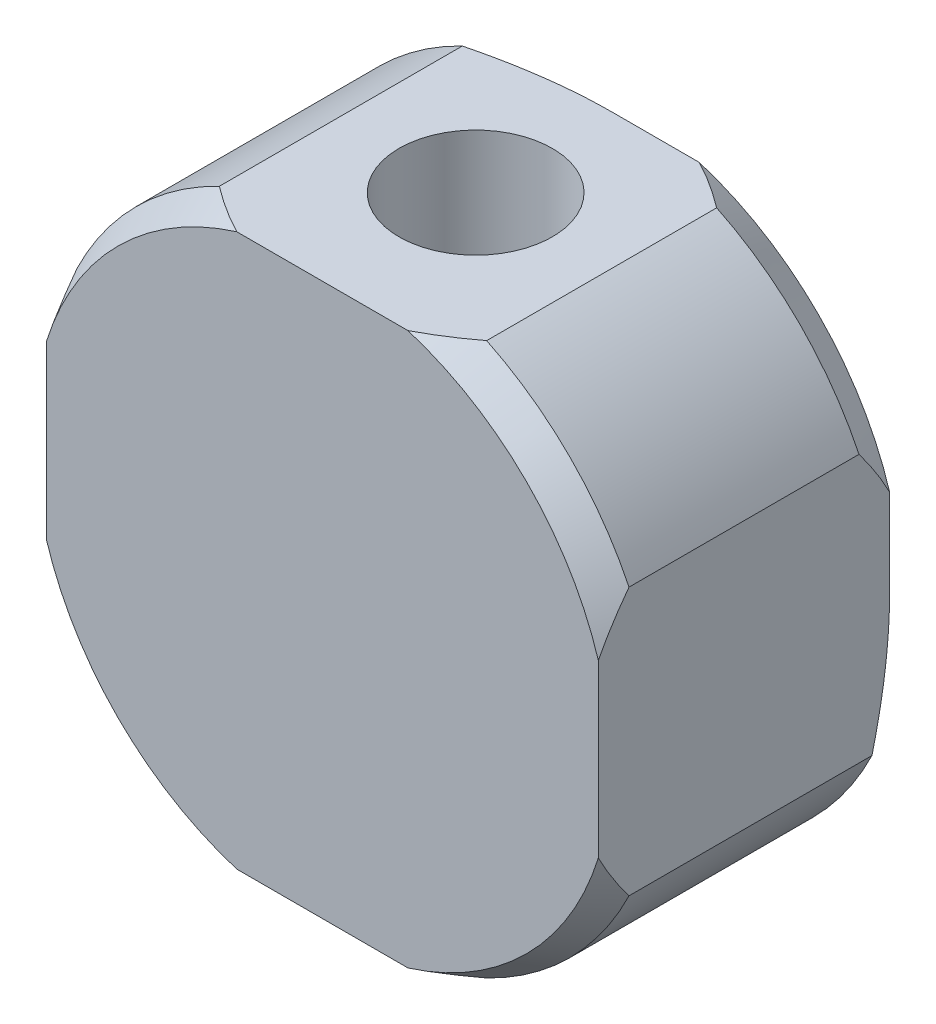
ISO-10303-21;
HEADER;
FILE_DESCRIPTION(('STEP AP214'),'2;1');
FILE_NAME('part.step','',(''),(''),'','','');
FILE_SCHEMA(('AUTOMOTIVE_DESIGN { 1 0 10303 214 1 1 1 1 }'));
ENDSEC;
DATA;
#1=APPLICATION_CONTEXT('core data for automotive mechanical design processes');
#2=APPLICATION_PROTOCOL_DEFINITION('international standard','automotive_design',2000,#1);
#3=PRODUCT_CONTEXT('',#1,'mechanical');
#4=PRODUCT('Part','Part','',(#3));
#5=PRODUCT_RELATED_PRODUCT_CATEGORY('part','',(#4));
#6=PRODUCT_DEFINITION_FORMATION('','',#4);
#7=PRODUCT_DEFINITION_CONTEXT('part definition',#1,'design');
#8=PRODUCT_DEFINITION('design','',#6,#7);
#9=PRODUCT_DEFINITION_SHAPE('','',#8);
#10=(LENGTH_UNIT() NAMED_UNIT(*) SI_UNIT(.MILLI.,.METRE.));
#11=(NAMED_UNIT(*) PLANE_ANGLE_UNIT() SI_UNIT($,.RADIAN.));
#12=(NAMED_UNIT(*) SI_UNIT($,.STERADIAN.) SOLID_ANGLE_UNIT());
#13=UNCERTAINTY_MEASURE_WITH_UNIT(LENGTH_MEASURE(1.E-05),#10,'distance_accuracy_value','');
#14=(GEOMETRIC_REPRESENTATION_CONTEXT(3) GLOBAL_UNCERTAINTY_ASSIGNED_CONTEXT((#13)) GLOBAL_UNIT_ASSIGNED_CONTEXT((#10,
#11,#12)) REPRESENTATION_CONTEXT('',''));
#15=CARTESIAN_POINT('',(0.,0.,0.));
#16=DIRECTION('',(0.,0.,1.));
#17=DIRECTION('',(1.,0.,0.));
#18=AXIS2_PLACEMENT_3D('',#15,#16,#17);
#19=CARTESIAN_POINT('',(0.,0.,9.50000000000001));
#20=DIRECTION('',(0.,0.,-1.));
#21=DIRECTION('',(-1.,0.,0.));
#22=AXIS2_PLACEMENT_3D('',#19,#20,#21);
#23=CYLINDRICAL_SURFACE('',#22,10.);
#24=DIRECTION('',(0.,0.,-1.));
#25=VECTOR('',#24,1.);
#26=CARTESIAN_POINT('',(-4.35889894354067,9.,9.5));
#27=LINE('',#26,#25);
#28=CARTESIAN_POINT('',(-4.35889894354068,9.,8.5));
#29=VERTEX_POINT('',#28);
#30=CARTESIAN_POINT('',(-4.35889894354068,9.,0.57735026918964));
#31=VERTEX_POINT('',#30);
#32=EDGE_CURVE('E364',#29,#31,#27,.T.);
#33=ORIENTED_EDGE('',*,*,#32,.T.);
#34=CARTESIAN_POINT('',(0.,0.,0.57735026918964));
#35=DIRECTION('',(0.,0.,1.));
#36=DIRECTION('',(1.,0.,0.));
#37=AXIS2_PLACEMENT_3D('',#34,#35,#36);
#38=CIRCLE('',#37,10.);
#39=CARTESIAN_POINT('',(-8.99999999999999,4.35889894354068,0.57735026918964));
#40=VERTEX_POINT('',#39);
#41=EDGE_CURVE('E398',#31,#40,#38,.T.);
#42=ORIENTED_EDGE('',*,*,#41,.T.);
#43=DIRECTION('',(0.,0.,-1.));
#44=VECTOR('',#43,1.);
#45=CARTESIAN_POINT('',(-8.99999999999999,4.35889894354068,9.5));
#46=LINE('',#45,#44);
#47=CARTESIAN_POINT('',(-8.99999999999999,4.35889894354068,8.5));
#48=VERTEX_POINT('',#47);
#49=EDGE_CURVE('E172',#48,#40,#46,.T.);
#50=ORIENTED_EDGE('',*,*,#49,.F.);
#51=CARTESIAN_POINT('',(0.,0.,8.5));
#52=DIRECTION('',(0.,0.,1.));
#53=DIRECTION('',(1.,0.,0.));
#54=AXIS2_PLACEMENT_3D('',#51,#52,#53);
#55=CIRCLE('',#54,10.);
#56=EDGE_CURVE('E231',#48,#29,#55,.F.);
#57=ORIENTED_EDGE('',*,*,#56,.T.);
#58=EDGE_LOOP('',(#33,#42,#50,#57));
#59=FACE_BOUND('',#58,.T.);
#60=ADVANCED_FACE('F36',(#59),#23,.T.);
#61=CARTESIAN_POINT('',(-8.99999999999999,4.35889894354068,9.5));
#62=DIRECTION('',(1.,0.,0.));
#63=DIRECTION('',(0.,0.,-1.));
#64=AXIS2_PLACEMENT_3D('',#61,#62,#63);
#65=PLANE('',#64);
#66=CARTESIAN_POINT('',(-8.99999999999999,4.35889894354068,0.57735026918964));
#67=CARTESIAN_POINT('',(-8.99999999999999,4.18050314028204,0.532457731019372));
#68=CARTESIAN_POINT('',(-8.99999999999999,4.00158687455103,0.489662216447558));
#69=CARTESIAN_POINT('',(-8.99999999999999,3.64267909672018,0.408660352341656));
#70=CARTESIAN_POINT('',(-8.99999999999999,3.46268735803343,0.370455008449583));
#71=CARTESIAN_POINT('',(-8.99999999999999,2.92263369369887,0.263635914482176));
#72=CARTESIAN_POINT('',(-8.99999999999999,2.56104121567905,0.202447293964424));
#73=CARTESIAN_POINT('',(-8.99999999999999,2.01622879853901,0.127817138854854));
#74=CARTESIAN_POINT('',(-8.99999999999999,1.83415074090355,0.105794088399089));
#75=CARTESIAN_POINT('',(-8.99999999999999,1.46935836557093,0.0677765215745436));
#76=CARTESIAN_POINT('',(-8.99999999999999,1.28664405347709,0.0517819522494305));
#77=CARTESIAN_POINT('',(-8.99999999999999,0.920066567165593,0.0260225867141355));
#78=CARTESIAN_POINT('',(-8.99999999999999,0.736201681512133,0.0162820951657872));
#79=CARTESIAN_POINT('',(-8.99999999999999,0.368226238571734,0.00326145442248733));
#80=CARTESIAN_POINT('',(-8.99999999999999,0.184115659254637,-1.80701811820628E-05));
#81=CARTESIAN_POINT('',(-8.99999999999999,0.,0.));
#82=B_SPLINE_CURVE_WITH_KNOTS('',3,(#66,#67,#68,#69,#70,#71,#72,#73,#74,#75,#76,#77,#78,#79,#80,
#81),.UNSPECIFIED.,.F.,.F.,(4,2,2,2,2,2,2,4),(0.,0.551840476747493,1.10380163438757,
2.2032324326341,2.75336800253714,3.30349873974013,3.85575466358834,4.40806397221874),.UNSPECIFIED.);
#83=CARTESIAN_POINT('',(-8.99999999999999,0.,0.));
#84=VERTEX_POINT('',#83);
#85=EDGE_CURVE('E277',#40,#84,#82,.T.);
#86=ORIENTED_EDGE('',*,*,#85,.T.);
#87=CARTESIAN_POINT('',(-8.99999999999999,0.,0.));
#88=CARTESIAN_POINT('',(-8.99999999999999,-0.184115659254637,-1.80701811821671E-05));
#89=CARTESIAN_POINT('',(-8.99999999999999,-0.368226238571734,0.00326145442248723));
#90=CARTESIAN_POINT('',(-8.99999999999999,-0.736201681512132,0.0162820951657872));
#91=CARTESIAN_POINT('',(-8.99999999999999,-0.920066567165592,0.0260225867141355));
#92=CARTESIAN_POINT('',(-8.99999999999999,-1.28664405347709,0.0517819522494306));
#93=CARTESIAN_POINT('',(-8.99999999999999,-1.46935836557093,0.0677765215745436));
#94=CARTESIAN_POINT('',(-8.99999999999999,-1.83415074090355,0.105794088399089));
#95=CARTESIAN_POINT('',(-8.99999999999999,-2.016228798539,0.127817138854854));
#96=CARTESIAN_POINT('',(-8.99999999999999,-2.56104121567905,0.202447293964424));
#97=CARTESIAN_POINT('',(-8.99999999999999,-2.92263369369887,0.263635914482176));
#98=CARTESIAN_POINT('',(-8.99999999999999,-3.46268735803343,0.370455008449582));
#99=CARTESIAN_POINT('',(-8.99999999999999,-3.64267909672018,0.408660352341655));
#100=CARTESIAN_POINT('',(-8.99999999999999,-4.00158687455103,0.489662216447558));
#101=CARTESIAN_POINT('',(-8.99999999999999,-4.18050314028204,0.532457731019371));
#102=CARTESIAN_POINT('',(-8.99999999999999,-4.35889894354068,0.57735026918964));
#103=B_SPLINE_CURVE_WITH_KNOTS('',3,(#87,#88,#89,#90,#91,#92,#93,#94,#95,#96,#97,#98,#99,#100,
#101,#102),.UNSPECIFIED.,.F.,.F.,(4,2,2,2,2,2,2,4),(0.,0.552309308630403,1.10456523247861,
1.6546959696816,2.20483153958464,3.30426233783117,3.85622349547125,4.40806397221874),.UNSPECIFIED.);
#104=CARTESIAN_POINT('',(-8.99999999999999,-4.35889894354068,0.57735026918964));
#105=VERTEX_POINT('',#104);
#106=EDGE_CURVE('E270',#84,#105,#103,.T.);
#107=ORIENTED_EDGE('',*,*,#106,.T.);
#108=DIRECTION('',(0.,0.,-1.));
#109=VECTOR('',#108,1.);
#110=CARTESIAN_POINT('',(-8.99999999999999,-4.35889894354068,9.5));
#111=LINE('',#110,#109);
#112=CARTESIAN_POINT('',(-8.99999999999999,-4.35889894354068,8.5));
#113=VERTEX_POINT('',#112);
#114=EDGE_CURVE('E166',#113,#105,#111,.T.);
#115=ORIENTED_EDGE('',*,*,#114,.F.);
#116=CARTESIAN_POINT('',(-8.99999999999999,-4.35889894354068,8.5));
#117=CARTESIAN_POINT('',(-8.99999999999999,-4.23493665683502,8.59356981138573));
#118=CARTESIAN_POINT('',(-8.99999999999999,-4.10941613597258,8.6851212040339));
#119=CARTESIAN_POINT('',(-8.99999999999999,-3.85525157762108,8.86325943967017));
#120=CARTESIAN_POINT('',(-8.99999999999999,-3.726613733126,8.94985513426066));
#121=CARTESIAN_POINT('',(-8.99999999999999,-3.46572204359342,9.11752430951137));
#122=CARTESIAN_POINT('',(-8.99999999999999,-3.333467384821,9.19859653289942));
#123=CARTESIAN_POINT('',(-8.99999999999999,-3.06494049887311,9.35437237002738));
#124=CARTESIAN_POINT('',(-8.99999999999999,-2.92866129078794,9.42906392238571));
#125=CARTESIAN_POINT('',(-8.99999999999999,-2.79039924554546,9.5));
#126=B_SPLINE_CURVE_WITH_KNOTS('',3,(#116,#117,#118,#119,#120,#121,#122,#123,#124,#125),
.UNSPECIFIED.,.F.,.F.,(4,2,2,2,4),(0.,0.465956165727929,0.931052274582842,1.39625389899086,
1.86231628481113),.UNSPECIFIED.);
#127=CARTESIAN_POINT('',(-8.99999999999999,-2.79039924554546,9.5));
#128=VERTEX_POINT('',#127);
#129=EDGE_CURVE('E171',#113,#128,#126,.T.);
#130=ORIENTED_EDGE('',*,*,#129,.T.);
#131=DIRECTION('',(0.,-1.,0.));
#132=VECTOR('',#131,1.);
#133=CARTESIAN_POINT('',(-8.99999999999999,4.35889894354068,9.5));
#134=LINE('',#133,#132);
#135=CARTESIAN_POINT('',(-8.99999999999999,2.79039924554546,9.5));
#136=VERTEX_POINT('',#135);
#137=EDGE_CURVE('E350',#136,#128,#134,.T.);
#138=ORIENTED_EDGE('',*,*,#137,.F.);
#139=CARTESIAN_POINT('',(-8.99999999999999,2.79039924554546,9.5));
#140=CARTESIAN_POINT('',(-8.99999999999999,2.92866129078794,9.42906392238571));
#141=CARTESIAN_POINT('',(-8.99999999999999,3.06494049887311,9.35437237002738));
#142=CARTESIAN_POINT('',(-8.99999999999999,3.333467384821,9.19859653289942));
#143=CARTESIAN_POINT('',(-8.99999999999999,3.46572204359342,9.11752430951137));
#144=CARTESIAN_POINT('',(-8.99999999999999,3.726613733126,8.94985513426065));
#145=CARTESIAN_POINT('',(-8.99999999999999,3.85525157762108,8.86325943967017));
#146=CARTESIAN_POINT('',(-8.99999999999999,4.10941613597259,8.6851212040339));
#147=CARTESIAN_POINT('',(-8.99999999999999,4.23493665683503,8.59356981138573));
#148=CARTESIAN_POINT('',(-8.99999999999999,4.35889894354068,8.5));
#149=B_SPLINE_CURVE_WITH_KNOTS('',3,(#139,#140,#141,#142,#143,#144,#145,#146,#147,#148),
.UNSPECIFIED.,.F.,.F.,(4,2,2,2,4),(0.,0.466062385820271,0.931264010228286,1.3963601190832,
1.86231628481113),.UNSPECIFIED.);
#150=EDGE_CURVE('E294',#136,#48,#149,.T.);
#151=ORIENTED_EDGE('',*,*,#150,.T.);
#152=ORIENTED_EDGE('',*,*,#49,.T.);
#153=EDGE_LOOP('',(#86,#107,#115,#130,#138,#151,#152));
#154=FACE_BOUND('',#153,.T.);
#155=ADVANCED_FACE('F282',(#154),#65,.F.);
#156=CARTESIAN_POINT('',(0.,0.,9.50000000000001));
#157=DIRECTION('',(0.,0.,-1.));
#158=DIRECTION('',(-1.,0.,0.));
#159=AXIS2_PLACEMENT_3D('',#156,#157,#158);
#160=CYLINDRICAL_SURFACE('',#159,10.);
#161=ORIENTED_EDGE('',*,*,#114,.T.);
#162=CARTESIAN_POINT('',(0.,0.,0.57735026918964));
#163=DIRECTION('',(0.,0.,1.));
#164=DIRECTION('',(1.,0.,0.));
#165=AXIS2_PLACEMENT_3D('',#162,#163,#164);
#166=CIRCLE('',#165,10.);
#167=CARTESIAN_POINT('',(-4.35889894354068,-9.,0.57735026918964));
#168=VERTEX_POINT('',#167);
#169=EDGE_CURVE('E165',#105,#168,#166,.T.);
#170=ORIENTED_EDGE('',*,*,#169,.T.);
#171=DIRECTION('',(0.,0.,-1.));
#172=VECTOR('',#171,1.);
#173=CARTESIAN_POINT('',(-4.35889894354067,-9.,9.5));
#174=LINE('',#173,#172);
#175=CARTESIAN_POINT('',(-4.35889894354068,-9.,8.5));
#176=VERTEX_POINT('',#175);
#177=EDGE_CURVE('E148',#176,#168,#174,.T.);
#178=ORIENTED_EDGE('',*,*,#177,.F.);
#179=CARTESIAN_POINT('',(0.,0.,8.5));
#180=DIRECTION('',(0.,0.,1.));
#181=DIRECTION('',(1.,0.,0.));
#182=AXIS2_PLACEMENT_3D('',#179,#180,#181);
#183=CIRCLE('',#182,10.);
#184=EDGE_CURVE('E162',#176,#113,#183,.F.);
#185=ORIENTED_EDGE('',*,*,#184,.T.);
#186=EDGE_LOOP('',(#161,#170,#178,#185));
#187=FACE_BOUND('',#186,.T.);
#188=ADVANCED_FACE('F161',(#187),#160,.T.);
#189=CARTESIAN_POINT('',(-4.35889894354067,-9.,9.5));
#190=DIRECTION('',(0.,1.,0.));
#191=DIRECTION('',(0.,0.,1.));
#192=AXIS2_PLACEMENT_3D('',#189,#190,#191);
#193=PLANE('',#192);
#194=ORIENTED_EDGE('',*,*,#177,.T.);
#195=CARTESIAN_POINT('',(-4.35889894354068,-9.,0.57735026918964));
#196=CARTESIAN_POINT('',(-4.18050314028204,-9.,0.532457731019375));
#197=CARTESIAN_POINT('',(-4.00158687455103,-9.,0.489662216447562));
#198=CARTESIAN_POINT('',(-3.64267909672018,-9.,0.40866035234166));
#199=CARTESIAN_POINT('',(-3.46268735803343,-9.,0.370455008449586));
#200=CARTESIAN_POINT('',(-2.92263369369887,-9.,0.263635914482179));
#201=CARTESIAN_POINT('',(-2.56104121567905,-9.,0.202447293964428));
#202=CARTESIAN_POINT('',(-2.016228798539,-9.,0.127817138854858));
#203=CARTESIAN_POINT('',(-1.83415074090355,-9.,0.105794088399093));
#204=CARTESIAN_POINT('',(-1.46935836557093,-9.,0.0677765215745475));
#205=CARTESIAN_POINT('',(-1.28664405347709,-9.,0.0517819522494343));
#206=CARTESIAN_POINT('',(-0.920066567165593,-9.,0.0260225867141398));
#207=CARTESIAN_POINT('',(-0.736201681512133,-9.,0.0162820951657923));
#208=CARTESIAN_POINT('',(-0.368226238571734,-9.,0.00326145442249024));
#209=CARTESIAN_POINT('',(-0.184115659254636,-9.,-1.80701811820414E-05));
#210=CARTESIAN_POINT('',(0.,-9.,0.));
#211=B_SPLINE_CURVE_WITH_KNOTS('',3,(#195,#196,#197,#198,#199,#200,#201,#202,#203,#204,#205,
#206,#207,#208,#209,#210),.UNSPECIFIED.,.F.,.F.,(4,2,2,2,2,2,2,4),(0.,0.551840476747492,
1.10380163438757,2.2032324326341,2.75336800253714,3.30349873974013,3.85575466358834,
4.40806397221874),.UNSPECIFIED.);
#212=CARTESIAN_POINT('',(0.,-9.,0.));
#213=VERTEX_POINT('',#212);
#214=EDGE_CURVE('E206',#168,#213,#211,.T.);
#215=ORIENTED_EDGE('',*,*,#214,.T.);
#216=CARTESIAN_POINT('',(0.,-8.99999999999999,0.));
#217=CARTESIAN_POINT('',(0.184115659254635,-9.,-1.80701811828591E-05));
#218=CARTESIAN_POINT('',(0.368226238571732,-9.,0.00326145442248969));
#219=CARTESIAN_POINT('',(0.73620168151213,-9.,0.0162820951657926));
#220=CARTESIAN_POINT('',(0.920066567165589,-9.,0.0260225867141408));
#221=CARTESIAN_POINT('',(1.28664405347708,-9.,0.0517819522494353));
#222=CARTESIAN_POINT('',(1.46935836557093,-9.,0.0677765215745478));
#223=CARTESIAN_POINT('',(1.83415074090354,-9.,0.105794088399093));
#224=CARTESIAN_POINT('',(2.016228798539,-9.,0.127817138854858));
#225=CARTESIAN_POINT('',(2.56104121567904,-9.,0.202447293964428));
#226=CARTESIAN_POINT('',(2.92263369369887,-9.,0.263635914482178));
#227=CARTESIAN_POINT('',(3.46268735803342,-9.,0.370455008449584));
#228=CARTESIAN_POINT('',(3.64267909672017,-9.,0.408660352341658));
#229=CARTESIAN_POINT('',(4.00158687455102,-9.,0.489662216447559));
#230=CARTESIAN_POINT('',(4.18050314028203,-9.,0.532457731019373));
#231=CARTESIAN_POINT('',(4.35889894354067,-9.,0.57735026918964));
#232=B_SPLINE_CURVE_WITH_KNOTS('',3,(#216,#217,#218,#219,#220,#221,#222,#223,#224,#225,#226,
#227,#228,#229,#230,#231),.UNSPECIFIED.,.F.,.F.,(4,2,2,2,2,2,2,4),(0.,0.552309308630401,
1.10456523247861,1.65469596968159,2.20483153958464,3.30426233783117,3.85622349547124,
4.40806397221873),.UNSPECIFIED.);
#233=CARTESIAN_POINT('',(4.35889894354067,-9.,0.57735026918964));
#234=VERTEX_POINT('',#233);
#235=EDGE_CURVE('E155',#213,#234,#232,.T.);
#236=ORIENTED_EDGE('',*,*,#235,.T.);
#237=DIRECTION('',(0.,0.,-1.));
#238=VECTOR('',#237,1.);
#239=CARTESIAN_POINT('',(4.35889894354067,-9.,9.5));
#240=LINE('',#239,#238);
#241=CARTESIAN_POINT('',(4.35889894354067,-9.,8.49999999999999));
#242=VERTEX_POINT('',#241);
#243=EDGE_CURVE('E167',#242,#234,#240,.T.);
#244=ORIENTED_EDGE('',*,*,#243,.F.);
#245=CARTESIAN_POINT('',(4.35889894354067,-9.,8.49999999999999));
#246=CARTESIAN_POINT('',(4.23493665683502,-9.,8.59356981138573));
#247=CARTESIAN_POINT('',(4.10941613597258,-9.,8.6851212040339));
#248=CARTESIAN_POINT('',(3.85525157762108,-9.,8.86325943967016));
#249=CARTESIAN_POINT('',(3.72661373312599,-9.,8.94985513426065));
#250=CARTESIAN_POINT('',(3.46572204359341,-9.,9.11752430951136));
#251=CARTESIAN_POINT('',(3.33346738482099,-9.,9.19859653289941));
#252=CARTESIAN_POINT('',(3.0649404988731,-9.,9.35437237002738));
#253=CARTESIAN_POINT('',(2.92866129078794,-9.,9.42906392238571));
#254=CARTESIAN_POINT('',(2.79039924554546,-9.,9.5));
#255=B_SPLINE_CURVE_WITH_KNOTS('',3,(#245,#246,#247,#248,#249,#250,#251,#252,#253,#254),
.UNSPECIFIED.,.F.,.F.,(4,2,2,2,4),(0.,0.465956165727928,0.931052274582843,1.39625389899086,
1.86231628481113),.UNSPECIFIED.);
#256=CARTESIAN_POINT('',(2.79039924554546,-9.,9.5));
#257=VERTEX_POINT('',#256);
#258=EDGE_CURVE('E156',#242,#257,#255,.T.);
#259=ORIENTED_EDGE('',*,*,#258,.T.);
#260=DIRECTION('',(1.,0.,0.));
#261=VECTOR('',#260,1.);
#262=CARTESIAN_POINT('',(-4.35889894354067,-9.,9.5));
#263=LINE('',#262,#261);
#264=CARTESIAN_POINT('',(-2.79039924554544,-9.,9.5));
#265=VERTEX_POINT('',#264);
#266=EDGE_CURVE('E150',#265,#257,#263,.T.);
#267=ORIENTED_EDGE('',*,*,#266,.F.);
#268=CARTESIAN_POINT('',(-2.79039924554544,-9.,9.5));
#269=CARTESIAN_POINT('',(-2.92866129078793,-9.,9.42906392238572));
#270=CARTESIAN_POINT('',(-3.06494049887309,-9.,9.35437237002738));
#271=CARTESIAN_POINT('',(-3.33346738482099,-9.,9.19859653289941));
#272=CARTESIAN_POINT('',(-3.4657220435934,-9.,9.11752430951136));
#273=CARTESIAN_POINT('',(-3.72661373312598,-9.,8.94985513426065));
#274=CARTESIAN_POINT('',(-3.85525157762107,-9.,8.86325943967016));
#275=CARTESIAN_POINT('',(-4.10941613597258,-9.,8.6851212040339));
#276=CARTESIAN_POINT('',(-4.23493665683502,-9.,8.59356981138573));
#277=CARTESIAN_POINT('',(-4.35889894354068,-9.,8.5));
#278=B_SPLINE_CURVE_WITH_KNOTS('',3,(#268,#269,#270,#271,#272,#273,#274,#275,#276,#277),
.UNSPECIFIED.,.F.,.F.,(4,2,2,2,4),(0.,0.466062385820276,0.931264010228295,1.39636011908321,
1.86231628481115),.UNSPECIFIED.);
#279=EDGE_CURVE('E144',#265,#176,#278,.T.);
#280=ORIENTED_EDGE('',*,*,#279,.T.);
#281=EDGE_LOOP('',(#194,#215,#236,#244,#259,#267,#280));
#282=FACE_BOUND('',#281,.T.);
#283=ADVANCED_FACE('F146',(#282),#193,.F.);
#284=CARTESIAN_POINT('',(0.,0.,9.50000000000001));
#285=DIRECTION('',(0.,0.,-1.));
#286=DIRECTION('',(-1.,0.,0.));
#287=AXIS2_PLACEMENT_3D('',#284,#285,#286);
#288=CYLINDRICAL_SURFACE('',#287,10.);
#289=ORIENTED_EDGE('',*,*,#243,.T.);
#290=CARTESIAN_POINT('',(0.,0.,0.57735026918964));
#291=DIRECTION('',(0.,0.,1.));
#292=DIRECTION('',(1.,0.,0.));
#293=AXIS2_PLACEMENT_3D('',#290,#291,#292);
#294=CIRCLE('',#293,10.);
#295=CARTESIAN_POINT('',(8.99999999999999,-4.35889894354068,0.57735026918964));
#296=VERTEX_POINT('',#295);
#297=EDGE_CURVE('E261',#234,#296,#294,.T.);
#298=ORIENTED_EDGE('',*,*,#297,.T.);
#299=DIRECTION('',(0.,0.,-1.));
#300=VECTOR('',#299,1.);
#301=CARTESIAN_POINT('',(8.99999999999999,-4.35889894354068,9.5));
#302=LINE('',#301,#300);
#303=CARTESIAN_POINT('',(8.99999999999999,-4.35889894354068,8.5));
#304=VERTEX_POINT('',#303);
#305=EDGE_CURVE('E372',#304,#296,#302,.T.);
#306=ORIENTED_EDGE('',*,*,#305,.F.);
#307=CARTESIAN_POINT('',(0.,0.,8.5));
#308=DIRECTION('',(0.,0.,1.));
#309=DIRECTION('',(1.,0.,0.));
#310=AXIS2_PLACEMENT_3D('',#307,#308,#309);
#311=CIRCLE('',#310,10.);
#312=EDGE_CURVE('E266',#304,#242,#311,.F.);
#313=ORIENTED_EDGE('',*,*,#312,.T.);
#314=EDGE_LOOP('',(#289,#298,#306,#313));
#315=FACE_BOUND('',#314,.T.);
#316=ADVANCED_FACE('F196',(#315),#288,.T.);
#317=CARTESIAN_POINT('',(8.99999999999999,4.35889894354068,9.5));
#318=DIRECTION('',(-1.,0.,0.));
#319=DIRECTION('',(0.,0.,1.));
#320=AXIS2_PLACEMENT_3D('',#317,#318,#319);
#321=PLANE('',#320);
#322=ORIENTED_EDGE('',*,*,#305,.T.);
#323=CARTESIAN_POINT('',(8.99999999999999,-4.35889894354068,0.57735026918964));
#324=CARTESIAN_POINT('',(8.99999999999999,-4.18050314028204,0.532457731019372));
#325=CARTESIAN_POINT('',(8.99999999999999,-4.00158687455103,0.489662216447559));
#326=CARTESIAN_POINT('',(8.99999999999999,-3.64267909672018,0.408660352341657));
#327=CARTESIAN_POINT('',(8.99999999999999,-3.46268735803343,0.370455008449583));
#328=CARTESIAN_POINT('',(8.99999999999999,-2.92263369369887,0.263635914482177));
#329=CARTESIAN_POINT('',(8.99999999999999,-2.56104121567905,0.202447293964425));
#330=CARTESIAN_POINT('',(8.99999999999999,-2.01622879853901,0.127817138854855));
#331=CARTESIAN_POINT('',(8.99999999999999,-1.83415074090355,0.10579408839909));
#332=CARTESIAN_POINT('',(8.99999999999999,-1.46935836557093,0.0677765215745445));
#333=CARTESIAN_POINT('',(8.99999999999999,-1.28664405347709,0.0517819522494314));
#334=CARTESIAN_POINT('',(8.99999999999999,-0.920066567165593,0.0260225867141365));
#335=CARTESIAN_POINT('',(8.99999999999999,-0.736201681512133,0.0162820951657883));
#336=CARTESIAN_POINT('',(8.99999999999999,-0.368226238571734,0.00326145442248819));
#337=CARTESIAN_POINT('',(8.99999999999999,-0.184115659254637,-1.80701811814738E-05));
#338=CARTESIAN_POINT('',(8.99999999999999,0.,0.));
#339=B_SPLINE_CURVE_WITH_KNOTS('',3,(#323,#324,#325,#326,#327,#328,#329,#330,#331,#332,#333,
#334,#335,#336,#337,#338),.UNSPECIFIED.,.F.,.F.,(4,2,2,2,2,2,2,4),(0.,0.551840476747493,
1.10380163438757,2.2032324326341,2.75336800253714,3.30349873974013,3.85575466358834,
4.40806397221874),.UNSPECIFIED.);
#340=CARTESIAN_POINT('',(8.99999999999999,0.,0.));
#341=VERTEX_POINT('',#340);
#342=EDGE_CURVE('E225',#296,#341,#339,.T.);
#343=ORIENTED_EDGE('',*,*,#342,.T.);
#344=DIRECTION('',(0.,1.,0.));
#345=VECTOR('',#344,1.);
#346=CARTESIAN_POINT('',(8.99999999999999,4.35889894354068,0.));
#347=LINE('',#346,#345);
#348=CARTESIAN_POINT('',(8.99999999999999,2.79039924554546,0.));
#349=VERTEX_POINT('',#348);
#350=EDGE_CURVE('E357',#341,#349,#347,.T.);
#351=ORIENTED_EDGE('',*,*,#350,.T.);
#352=CARTESIAN_POINT('',(8.99999999999999,2.79039924554546,0.));
#353=CARTESIAN_POINT('',(8.99999999999999,2.92866129078794,0.0709360776142915));
#354=CARTESIAN_POINT('',(8.99999999999999,3.0649404988731,0.145627629972627));
#355=CARTESIAN_POINT('',(8.99999999999999,3.333467384821,0.301403467100593));
#356=CARTESIAN_POINT('',(8.99999999999999,3.46572204359342,0.382475690488642));
#357=CARTESIAN_POINT('',(8.99999999999999,3.726613733126,0.550144865739353));
#358=CARTESIAN_POINT('',(8.99999999999999,3.85525157762108,0.636740560329839));
#359=CARTESIAN_POINT('',(8.99999999999999,4.10941613597259,0.814878795966104));
#360=CARTESIAN_POINT('',(8.99999999999999,4.23493665683503,0.906430188614275));
#361=CARTESIAN_POINT('',(8.99999999999999,4.35889894354068,1.00000000000001));
#362=B_SPLINE_CURVE_WITH_KNOTS('',3,(#352,#353,#354,#355,#356,#357,#358,#359,#360,#361),
.UNSPECIFIED.,.F.,.F.,(4,2,2,2,4),(0.,0.466062385820273,0.931264010228288,1.3963601190832,
1.86231628481113),.UNSPECIFIED.);
#363=CARTESIAN_POINT('',(8.99999999999999,4.35889894354068,1.00000000000001));
#364=VERTEX_POINT('',#363);
#365=EDGE_CURVE('E232',#349,#364,#362,.T.);
#366=ORIENTED_EDGE('',*,*,#365,.T.);
#367=DIRECTION('',(0.,0.,-1.));
#368=VECTOR('',#367,1.);
#369=CARTESIAN_POINT('',(8.99999999999999,4.35889894354068,9.5));
#370=LINE('',#369,#368);
#371=CARTESIAN_POINT('',(8.99999999999999,4.35889894354068,8.5));
#372=VERTEX_POINT('',#371);
#373=EDGE_CURVE('E369',#372,#364,#370,.T.);
#374=ORIENTED_EDGE('',*,*,#373,.F.);
#375=CARTESIAN_POINT('',(8.99999999999999,4.35889894354068,8.5));
#376=CARTESIAN_POINT('',(8.99999999999999,4.23493665683503,8.59356981138573));
#377=CARTESIAN_POINT('',(8.99999999999999,4.10941613597259,8.6851212040339));
#378=CARTESIAN_POINT('',(8.99999999999999,3.85525157762108,8.86325943967017));
#379=CARTESIAN_POINT('',(8.99999999999999,3.726613733126,8.94985513426065));
#380=CARTESIAN_POINT('',(8.99999999999999,3.46572204359342,9.11752430951137));
#381=CARTESIAN_POINT('',(8.99999999999999,3.333467384821,9.19859653289942));
#382=CARTESIAN_POINT('',(8.99999999999999,3.06494049887311,9.35437237002738));
#383=CARTESIAN_POINT('',(8.99999999999999,2.92866129078794,9.42906392238571));
#384=CARTESIAN_POINT('',(8.99999999999999,2.79039924554546,9.5));
#385=B_SPLINE_CURVE_WITH_KNOTS('',3,(#375,#376,#377,#378,#379,#380,#381,#382,#383,#384),
.UNSPECIFIED.,.F.,.F.,(4,2,2,2,4),(0.,0.46595616572793,0.931052274582844,1.39625389899086,
1.86231628481113),.UNSPECIFIED.);
#386=CARTESIAN_POINT('',(8.99999999999999,2.79039924554546,9.5));
#387=VERTEX_POINT('',#386);
#388=EDGE_CURVE('E248',#372,#387,#385,.T.);
#389=ORIENTED_EDGE('',*,*,#388,.T.);
#390=DIRECTION('',(0.,1.,0.));
#391=VECTOR('',#390,1.);
#392=CARTESIAN_POINT('',(8.99999999999999,4.35889894354068,9.5));
#393=LINE('',#392,#391);
#394=CARTESIAN_POINT('',(8.99999999999999,-2.79039924554546,9.5));
#395=VERTEX_POINT('',#394);
#396=EDGE_CURVE('E354',#395,#387,#393,.T.);
#397=ORIENTED_EDGE('',*,*,#396,.F.);
#398=CARTESIAN_POINT('',(8.99999999999999,-2.79039924554546,9.5));
#399=CARTESIAN_POINT('',(8.99999999999999,-2.92866129078794,9.42906392238571));
#400=CARTESIAN_POINT('',(8.99999999999999,-3.06494049887311,9.35437237002738));
#401=CARTESIAN_POINT('',(8.99999999999999,-3.333467384821,9.19859653289942));
#402=CARTESIAN_POINT('',(8.99999999999999,-3.46572204359342,9.11752430951137));
#403=CARTESIAN_POINT('',(8.99999999999999,-3.726613733126,8.94985513426065));
#404=CARTESIAN_POINT('',(8.99999999999999,-3.85525157762108,8.86325943967017));
#405=CARTESIAN_POINT('',(8.99999999999999,-4.10941613597259,8.6851212040339));
#406=CARTESIAN_POINT('',(8.99999999999999,-4.23493665683503,8.59356981138573));
#407=CARTESIAN_POINT('',(8.99999999999999,-4.35889894354068,8.5));
#408=B_SPLINE_CURVE_WITH_KNOTS('',3,(#398,#399,#400,#401,#402,#403,#404,#405,#406,#407),
.UNSPECIFIED.,.F.,.F.,(4,2,2,2,4),(0.,0.466062385820271,0.931264010228286,1.3963601190832,
1.86231628481113),.UNSPECIFIED.);
#409=EDGE_CURVE('E254',#395,#304,#408,.T.);
#410=ORIENTED_EDGE('',*,*,#409,.T.);
#411=EDGE_LOOP('',(#322,#343,#351,#366,#374,#389,#397,#410));
#412=FACE_BOUND('',#411,.T.);
#413=ADVANCED_FACE('F238',(#412),#321,.F.);
#414=CARTESIAN_POINT('',(0.,0.,9.50000000000001));
#415=DIRECTION('',(0.,0.,-1.));
#416=DIRECTION('',(-1.,0.,0.));
#417=AXIS2_PLACEMENT_3D('',#414,#415,#416);
#418=CYLINDRICAL_SURFACE('',#417,10.);
#419=ORIENTED_EDGE('',*,*,#373,.T.);
#420=CARTESIAN_POINT('',(0.,0.,1.00000000000001));
#421=DIRECTION('',(0.,0.,1.));
#422=DIRECTION('',(1.,0.,0.));
#423=AXIS2_PLACEMENT_3D('',#420,#421,#422);
#424=CIRCLE('',#423,10.);
#425=CARTESIAN_POINT('',(4.35889894354068,9.,1.00000000000001));
#426=VERTEX_POINT('',#425);
#427=EDGE_CURVE('E338',#364,#426,#424,.T.);
#428=ORIENTED_EDGE('',*,*,#427,.T.);
#429=DIRECTION('',(0.,0.,-1.));
#430=VECTOR('',#429,1.);
#431=CARTESIAN_POINT('',(4.35889894354067,9.,9.5));
#432=LINE('',#431,#430);
#433=CARTESIAN_POINT('',(4.35889894354067,9.,8.49999999999999));
#434=VERTEX_POINT('',#433);
#435=EDGE_CURVE('E367',#434,#426,#432,.T.);
#436=ORIENTED_EDGE('',*,*,#435,.F.);
#437=CARTESIAN_POINT('',(0.,0.,8.5));
#438=DIRECTION('',(0.,0.,1.));
#439=DIRECTION('',(1.,0.,0.));
#440=AXIS2_PLACEMENT_3D('',#437,#438,#439);
#441=CIRCLE('',#440,10.);
#442=EDGE_CURVE('E336',#434,#372,#441,.F.);
#443=ORIENTED_EDGE('',*,*,#442,.T.);
#444=EDGE_LOOP('',(#419,#428,#436,#443));
#445=FACE_BOUND('',#444,.T.);
#446=ADVANCED_FACE('F242',(#445),#418,.T.);
#447=CARTESIAN_POINT('',(-4.35889894354067,9.,9.5));
#448=DIRECTION('',(0.,-1.,0.));
#449=DIRECTION('',(0.,0.,-1.));
#450=AXIS2_PLACEMENT_3D('',#447,#448,#449);
#451=PLANE('',#450);
#452=CARTESIAN_POINT('',(0.,9.,4.5));
#453=DIRECTION('',(0.,1.,0.));
#454=DIRECTION('',(-1.,0.,0.));
#455=AXIS2_PLACEMENT_3D('',#452,#453,#454);
#456=CIRCLE('',#455,2.5);
#457=CARTESIAN_POINT('',(-2.5,9.,4.5));
#458=VERTEX_POINT('',#457);
#459=EDGE_CURVE('E527',#458,#458,#456,.T.);
#460=ORIENTED_EDGE('',*,*,#459,.F.);
#461=EDGE_LOOP('',(#460));
#462=FACE_BOUND('',#461,.T.);
#463=DIRECTION('',(-1.,0.,0.));
#464=VECTOR('',#463,1.);
#465=CARTESIAN_POINT('',(-4.35889894354068,9.,0.));
#466=LINE('',#465,#464);
#467=CARTESIAN_POINT('',(2.79039924554544,9.,0.));
#468=VERTEX_POINT('',#467);
#469=CARTESIAN_POINT('',(0.,9.,0.));
#470=VERTEX_POINT('',#469);
#471=EDGE_CURVE('E352',#468,#470,#466,.T.);
#472=ORIENTED_EDGE('',*,*,#471,.T.);
#473=CARTESIAN_POINT('',(0.,8.99999999999999,0.));
#474=CARTESIAN_POINT('',(-0.184115659254637,9.,-1.80701811820211E-05));
#475=CARTESIAN_POINT('',(-0.368226238571734,9.,0.00326145442249025));
#476=CARTESIAN_POINT('',(-0.736201681512132,9.,0.0162820951657923));
#477=CARTESIAN_POINT('',(-0.920066567165592,9.,0.0260225867141398));
#478=CARTESIAN_POINT('',(-1.28664405347709,9.,0.0517819522494343));
#479=CARTESIAN_POINT('',(-1.46935836557093,9.,0.0677765215745475));
#480=CARTESIAN_POINT('',(-1.83415074090355,9.,0.105794088399093));
#481=CARTESIAN_POINT('',(-2.016228798539,9.,0.127817138854858));
#482=CARTESIAN_POINT('',(-2.56104121567905,9.,0.202447293964428));
#483=CARTESIAN_POINT('',(-2.92263369369887,9.,0.263635914482179));
#484=CARTESIAN_POINT('',(-3.46268735803343,9.,0.370455008449586));
#485=CARTESIAN_POINT('',(-3.64267909672018,9.,0.40866035234166));
#486=CARTESIAN_POINT('',(-4.00158687455103,9.,0.489662216447562));
#487=CARTESIAN_POINT('',(-4.18050314028204,9.,0.532457731019375));
#488=CARTESIAN_POINT('',(-4.35889894354068,9.,0.57735026918964));
#489=B_SPLINE_CURVE_WITH_KNOTS('',3,(#473,#474,#475,#476,#477,#478,#479,#480,#481,#482,#483,
#484,#485,#486,#487,#488),.UNSPECIFIED.,.F.,.F.,(4,2,2,2,2,2,2,4),(0.,0.552309308630403,
1.10456523247861,1.6546959696816,2.20483153958464,3.30426233783118,3.85622349547125,
4.40806397221874),.UNSPECIFIED.);
#490=EDGE_CURVE('E331',#470,#31,#489,.T.);
#491=ORIENTED_EDGE('',*,*,#490,.T.);
#492=ORIENTED_EDGE('',*,*,#32,.F.);
#493=CARTESIAN_POINT('',(-4.35889894354068,9.,8.5));
#494=CARTESIAN_POINT('',(-4.23493665683502,9.,8.59356981138573));
#495=CARTESIAN_POINT('',(-4.10941613597258,9.,8.6851212040339));
#496=CARTESIAN_POINT('',(-3.85525157762107,9.,8.86325943967016));
#497=CARTESIAN_POINT('',(-3.72661373312598,9.,8.94985513426065));
#498=CARTESIAN_POINT('',(-3.4657220435934,9.,9.11752430951136));
#499=CARTESIAN_POINT('',(-3.33346738482099,9.,9.19859653289941));
#500=CARTESIAN_POINT('',(-3.06494049887309,9.,9.35437237002738));
#501=CARTESIAN_POINT('',(-2.92866129078793,9.,9.42906392238572));
#502=CARTESIAN_POINT('',(-2.79039924554544,9.,9.5));
#503=B_SPLINE_CURVE_WITH_KNOTS('',3,(#493,#494,#495,#496,#497,#498,#499,#500,#501,#502),
.UNSPECIFIED.,.F.,.F.,(4,2,2,2,4),(0.,0.465956165727933,0.931052274582851,1.39625389899087,
1.86231628481115),.UNSPECIFIED.);
#504=CARTESIAN_POINT('',(-2.79039924554544,9.,9.5));
#505=VERTEX_POINT('',#504);
#506=EDGE_CURVE('E308',#29,#505,#503,.T.);
#507=ORIENTED_EDGE('',*,*,#506,.T.);
#508=DIRECTION('',(-1.,0.,0.));
#509=VECTOR('',#508,1.);
#510=CARTESIAN_POINT('',(-4.35889894354067,9.,9.5));
#511=LINE('',#510,#509);
#512=CARTESIAN_POINT('',(2.79039924554546,9.,9.5));
#513=VERTEX_POINT('',#512);
#514=EDGE_CURVE('E362',#513,#505,#511,.T.);
#515=ORIENTED_EDGE('',*,*,#514,.F.);
#516=CARTESIAN_POINT('',(2.79039924554546,9.,9.5));
#517=CARTESIAN_POINT('',(2.92866129078794,9.,9.42906392238571));
#518=CARTESIAN_POINT('',(3.0649404988731,9.,9.35437237002738));
#519=CARTESIAN_POINT('',(3.33346738482099,9.,9.19859653289941));
#520=CARTESIAN_POINT('',(3.46572204359341,9.,9.11752430951136));
#521=CARTESIAN_POINT('',(3.72661373312599,9.,8.94985513426065));
#522=CARTESIAN_POINT('',(3.85525157762108,9.,8.86325943967016));
#523=CARTESIAN_POINT('',(4.10941613597258,9.,8.6851212040339));
#524=CARTESIAN_POINT('',(4.23493665683502,9.,8.59356981138573));
#525=CARTESIAN_POINT('',(4.35889894354067,9.,8.49999999999999));
#526=B_SPLINE_CURVE_WITH_KNOTS('',3,(#516,#517,#518,#519,#520,#521,#522,#523,#524,#525),
.UNSPECIFIED.,.F.,.F.,(4,2,2,2,4),(0.,0.466062385820272,0.931264010228286,1.3963601190832,
1.86231628481113),.UNSPECIFIED.);
#527=EDGE_CURVE('E58',#513,#434,#526,.T.);
#528=ORIENTED_EDGE('',*,*,#527,.T.);
#529=ORIENTED_EDGE('',*,*,#435,.T.);
#530=CARTESIAN_POINT('',(4.35889894354068,9.,1.00000000000001));
#531=CARTESIAN_POINT('',(4.23493665683502,9.,0.906430188614278));
#532=CARTESIAN_POINT('',(4.10941613597257,9.,0.814878795966107));
#533=CARTESIAN_POINT('',(3.85525157762107,9.,0.636740560329843));
#534=CARTESIAN_POINT('',(3.72661373312598,9.,0.550144865739356));
#535=CARTESIAN_POINT('',(3.4657220435934,9.,0.382475690488644));
#536=CARTESIAN_POINT('',(3.33346738482098,9.,0.301403467100593));
#537=CARTESIAN_POINT('',(3.06494049887309,9.,0.145627629972628));
#538=CARTESIAN_POINT('',(2.92866129078792,9.,0.0709360776142944));
#539=CARTESIAN_POINT('',(2.79039924554544,9.,0.));
#540=B_SPLINE_CURVE_WITH_KNOTS('',3,(#530,#531,#532,#533,#534,#535,#536,#537,#538,#539),
.UNSPECIFIED.,.F.,.F.,(4,2,2,2,4),(0.,0.465956165727932,0.931052274582849,1.39625389899087,
1.86231628481114),.UNSPECIFIED.);
#541=EDGE_CURVE('E50',#426,#468,#540,.T.);
#542=ORIENTED_EDGE('',*,*,#541,.T.);
#543=EDGE_LOOP('',(#472,#491,#492,#507,#515,#528,#529,#542));
#544=FACE_BOUND('',#543,.T.);
#545=ADVANCED_FACE('F321',(#462,#544),#451,.F.);
#546=CARTESIAN_POINT('',(0.,0.,9.50000000000001));
#547=DIRECTION('',(0.,0.,1.));
#548=DIRECTION('',(1.,0.,0.));
#549=AXIS2_PLACEMENT_3D('',#546,#547,#548);
#550=PLANE('',#549);
#551=ORIENTED_EDGE('',*,*,#514,.T.);
#552=CARTESIAN_POINT('',(0.,0.,9.50000000000001));
#553=DIRECTION('',(0.,0.,1.));
#554=DIRECTION('',(1.,0.,0.));
#555=AXIS2_PLACEMENT_3D('',#552,#553,#554);
#556=CIRCLE('',#555,9.42264973081036);
#557=EDGE_CURVE('E11',#505,#136,#556,.T.);
#558=ORIENTED_EDGE('',*,*,#557,.T.);
#559=ORIENTED_EDGE('',*,*,#137,.T.);
#560=CARTESIAN_POINT('',(0.,0.,9.50000000000001));
#561=DIRECTION('',(0.,0.,1.));
#562=DIRECTION('',(1.,0.,0.));
#563=AXIS2_PLACEMENT_3D('',#560,#561,#562);
#564=CIRCLE('',#563,9.42264973081036);
#565=EDGE_CURVE('E43',#128,#265,#564,.T.);
#566=ORIENTED_EDGE('',*,*,#565,.T.);
#567=ORIENTED_EDGE('',*,*,#266,.T.);
#568=CARTESIAN_POINT('',(0.,0.,9.50000000000001));
#569=DIRECTION('',(0.,0.,1.));
#570=DIRECTION('',(1.,0.,0.));
#571=AXIS2_PLACEMENT_3D('',#568,#569,#570);
#572=CIRCLE('',#571,9.42264973081036);
#573=EDGE_CURVE('E343',#257,#395,#572,.T.);
#574=ORIENTED_EDGE('',*,*,#573,.T.);
#575=ORIENTED_EDGE('',*,*,#396,.T.);
#576=CARTESIAN_POINT('',(0.,0.,9.50000000000001));
#577=DIRECTION('',(0.,0.,1.));
#578=DIRECTION('',(1.,0.,0.));
#579=AXIS2_PLACEMENT_3D('',#576,#577,#578);
#580=CIRCLE('',#579,9.42264973081036);
#581=EDGE_CURVE('E340',#387,#513,#580,.T.);
#582=ORIENTED_EDGE('',*,*,#581,.T.);
#583=EDGE_LOOP('',(#551,#558,#559,#566,#567,#574,#575,#582));
#584=FACE_BOUND('',#583,.T.);
#585=ADVANCED_FACE('F325',(#584),#550,.T.);
#586=CARTESIAN_POINT('',(0.,0.,0.));
#587=DIRECTION('',(0.,0.,1.));
#588=DIRECTION('',(1.,0.,0.));
#589=AXIS2_PLACEMENT_3D('',#586,#587,#588);
#590=PLANE('',#589);
#591=ORIENTED_EDGE('',*,*,#350,.F.);
#592=CARTESIAN_POINT('',(0.,0.,0.));
#593=DIRECTION('',(0.,0.,1.));
#594=DIRECTION('',(1.,0.,0.));
#595=AXIS2_PLACEMENT_3D('',#592,#593,#594);
#596=CIRCLE('',#595,8.99999999999999);
#597=EDGE_CURVE('E389',#341,#213,#596,.F.);
#598=ORIENTED_EDGE('',*,*,#597,.T.);
#599=CARTESIAN_POINT('',(0.,0.,0.));
#600=DIRECTION('',(0.,0.,1.));
#601=DIRECTION('',(1.,0.,0.));
#602=AXIS2_PLACEMENT_3D('',#599,#600,#601);
#603=CIRCLE('',#602,9.);
#604=EDGE_CURVE('E379',#213,#84,#603,.F.);
#605=ORIENTED_EDGE('',*,*,#604,.T.);
#606=CARTESIAN_POINT('',(0.,0.,0.));
#607=DIRECTION('',(0.,0.,1.));
#608=DIRECTION('',(1.,0.,0.));
#609=AXIS2_PLACEMENT_3D('',#606,#607,#608);
#610=CIRCLE('',#609,9.);
#611=EDGE_CURVE('E382',#84,#470,#610,.F.);
#612=ORIENTED_EDGE('',*,*,#611,.T.);
#613=ORIENTED_EDGE('',*,*,#471,.F.);
#614=CARTESIAN_POINT('',(0.,0.,0.));
#615=DIRECTION('',(0.,0.,1.));
#616=DIRECTION('',(1.,0.,0.));
#617=AXIS2_PLACEMENT_3D('',#614,#615,#616);
#618=CIRCLE('',#617,9.42264973081036);
#619=EDGE_CURVE('E381',#468,#349,#618,.F.);
#620=ORIENTED_EDGE('',*,*,#619,.T.);
#621=EDGE_LOOP('',(#591,#598,#605,#612,#613,#620));
#622=FACE_BOUND('',#621,.T.);
#623=ADVANCED_FACE('F395',(#622),#590,.F.);
#624=CARTESIAN_POINT('',(0.,4.,4.5));
#625=DIRECTION('',(0.,1.,0.));
#626=DIRECTION('',(-1.,0.,0.));
#627=AXIS2_PLACEMENT_3D('',#624,#625,#626);
#628=CYLINDRICAL_SURFACE('',#627,2.5);
#629=CARTESIAN_POINT('',(0.,4.,4.5));
#630=DIRECTION('',(0.,1.,0.));
#631=DIRECTION('',(-1.,0.,0.));
#632=AXIS2_PLACEMENT_3D('',#629,#630,#631);
#633=CIRCLE('',#632,2.5);
#634=CARTESIAN_POINT('',(-2.5,4.,4.5));
#635=VERTEX_POINT('',#634);
#636=EDGE_CURVE('E525',#635,#635,#633,.T.);
#637=ORIENTED_EDGE('',*,*,#636,.F.);
#638=EDGE_LOOP('',(#637));
#639=FACE_BOUND('',#638,.T.);
#640=ORIENTED_EDGE('',*,*,#459,.T.);
#641=EDGE_LOOP('',(#640));
#642=FACE_BOUND('',#641,.T.);
#643=ADVANCED_FACE('F457',(#639,#642),#628,.F.);
#644=CARTESIAN_POINT('',(0.,4.,4.5));
#645=DIRECTION('',(0.,1.,0.));
#646=DIRECTION('',(-1.,0.,0.));
#647=AXIS2_PLACEMENT_3D('',#644,#645,#646);
#648=PLANE('',#647);
#649=ORIENTED_EDGE('',*,*,#636,.T.);
#650=EDGE_LOOP('',(#649));
#651=FACE_BOUND('',#650,.T.);
#652=ADVANCED_FACE('F463',(#651),#648,.T.);
#653=CARTESIAN_POINT('',(0.,0.,0.57735026918964));
#654=DIRECTION('',(0.,0.,1.));
#655=DIRECTION('',(1.,0.,0.));
#656=AXIS2_PLACEMENT_3D('',#653,#654,#655);
#657=CONICAL_SURFACE('',#656,10.,1.04719755119659);
#658=ORIENTED_EDGE('',*,*,#106,.F.);
#659=ORIENTED_EDGE('',*,*,#604,.F.);
#660=ORIENTED_EDGE('',*,*,#214,.F.);
#661=ORIENTED_EDGE('',*,*,#169,.F.);
#662=EDGE_LOOP('',(#658,#659,#660,#661));
#663=FACE_BOUND('',#662,.T.);
#664=ADVANCED_FACE('F217',(#663),#657,.T.);
#665=CARTESIAN_POINT('',(0.,0.,0.57735026918964));
#666=DIRECTION('',(0.,0.,1.));
#667=DIRECTION('',(1.,0.,0.));
#668=AXIS2_PLACEMENT_3D('',#665,#666,#667);
#669=CONICAL_SURFACE('',#668,10.,1.04719755119659);
#670=ORIENTED_EDGE('',*,*,#235,.F.);
#671=ORIENTED_EDGE('',*,*,#597,.F.);
#672=ORIENTED_EDGE('',*,*,#342,.F.);
#673=ORIENTED_EDGE('',*,*,#297,.F.);
#674=EDGE_LOOP('',(#670,#671,#672,#673));
#675=FACE_BOUND('',#674,.T.);
#676=ADVANCED_FACE('F212',(#675),#669,.T.);
#677=CARTESIAN_POINT('',(0.,0.,0.57735026918964));
#678=DIRECTION('',(0.,0.,1.));
#679=DIRECTION('',(1.,0.,0.));
#680=AXIS2_PLACEMENT_3D('',#677,#678,#679);
#681=CONICAL_SURFACE('',#680,10.,1.04719755119659);
#682=ORIENTED_EDGE('',*,*,#490,.F.);
#683=ORIENTED_EDGE('',*,*,#611,.F.);
#684=ORIENTED_EDGE('',*,*,#85,.F.);
#685=ORIENTED_EDGE('',*,*,#41,.F.);
#686=EDGE_LOOP('',(#682,#683,#684,#685));
#687=FACE_BOUND('',#686,.T.);
#688=ADVANCED_FACE('F216',(#687),#681,.T.);
#689=CARTESIAN_POINT('',(0.,0.,1.00000000000001));
#690=DIRECTION('',(0.,0.,1.));
#691=DIRECTION('',(1.,0.,0.));
#692=AXIS2_PLACEMENT_3D('',#689,#690,#691);
#693=CONICAL_SURFACE('',#692,10.,0.523598775598305);
#694=ORIENTED_EDGE('',*,*,#365,.F.);
#695=ORIENTED_EDGE('',*,*,#619,.F.);
#696=ORIENTED_EDGE('',*,*,#541,.F.);
#697=ORIENTED_EDGE('',*,*,#427,.F.);
#698=EDGE_LOOP('',(#694,#695,#696,#697));
#699=FACE_BOUND('',#698,.T.);
#700=ADVANCED_FACE('F302',(#699),#693,.T.);
#701=CARTESIAN_POINT('',(0.,0.,9.50000000000001));
#702=DIRECTION('',(0.,0.,-1.));
#703=DIRECTION('',(-1.,0.,0.));
#704=AXIS2_PLACEMENT_3D('',#701,#702,#703);
#705=CONICAL_SURFACE('',#704,9.42264973081036,0.523598775598305);
#706=ORIENTED_EDGE('',*,*,#506,.F.);
#707=ORIENTED_EDGE('',*,*,#56,.F.);
#708=ORIENTED_EDGE('',*,*,#150,.F.);
#709=ORIENTED_EDGE('',*,*,#557,.F.);
#710=EDGE_LOOP('',(#706,#707,#708,#709));
#711=FACE_BOUND('',#710,.T.);
#712=ADVANCED_FACE('F299',(#711),#705,.T.);
#713=CARTESIAN_POINT('',(0.,0.,9.50000000000001));
#714=DIRECTION('',(0.,0.,-1.));
#715=DIRECTION('',(-1.,0.,0.));
#716=AXIS2_PLACEMENT_3D('',#713,#714,#715);
#717=CONICAL_SURFACE('',#716,9.42264973081036,0.523598775598305);
#718=ORIENTED_EDGE('',*,*,#129,.F.);
#719=ORIENTED_EDGE('',*,*,#184,.F.);
#720=ORIENTED_EDGE('',*,*,#279,.F.);
#721=ORIENTED_EDGE('',*,*,#565,.F.);
#722=EDGE_LOOP('',(#718,#719,#720,#721));
#723=FACE_BOUND('',#722,.T.);
#724=ADVANCED_FACE('F170',(#723),#717,.T.);
#725=CARTESIAN_POINT('',(0.,0.,9.50000000000001));
#726=DIRECTION('',(0.,0.,-1.));
#727=DIRECTION('',(-1.,0.,0.));
#728=AXIS2_PLACEMENT_3D('',#725,#726,#727);
#729=CONICAL_SURFACE('',#728,9.42264973081036,0.523598775598305);
#730=ORIENTED_EDGE('',*,*,#258,.F.);
#731=ORIENTED_EDGE('',*,*,#312,.F.);
#732=ORIENTED_EDGE('',*,*,#409,.F.);
#733=ORIENTED_EDGE('',*,*,#573,.F.);
#734=EDGE_LOOP('',(#730,#731,#732,#733));
#735=FACE_BOUND('',#734,.T.);
#736=ADVANCED_FACE('F189',(#735),#729,.T.);
#737=CARTESIAN_POINT('',(0.,0.,9.50000000000001));
#738=DIRECTION('',(0.,0.,-1.));
#739=DIRECTION('',(-1.,0.,0.));
#740=AXIS2_PLACEMENT_3D('',#737,#738,#739);
#741=CONICAL_SURFACE('',#740,9.42264973081036,0.523598775598305);
#742=ORIENTED_EDGE('',*,*,#388,.F.);
#743=ORIENTED_EDGE('',*,*,#442,.F.);
#744=ORIENTED_EDGE('',*,*,#527,.F.);
#745=ORIENTED_EDGE('',*,*,#581,.F.);
#746=EDGE_LOOP('',(#742,#743,#744,#745));
#747=FACE_BOUND('',#746,.T.);
#748=ADVANCED_FACE('F404',(#747),#741,.T.);
#749=CLOSED_SHELL('',(#60,#155,#188,#283,#316,#413,#446,#545,#585,#623,#643,#652,#664,#676,#688,
#700,#712,#724,#736,#748));
#750=MANIFOLD_SOLID_BREP('B2',#749);
#751=ADVANCED_BREP_SHAPE_REPRESENTATION('',(#18,#750),#14);
#752=SHAPE_DEFINITION_REPRESENTATION(#9,#751);
ENDSEC;
END-ISO-10303-21;
